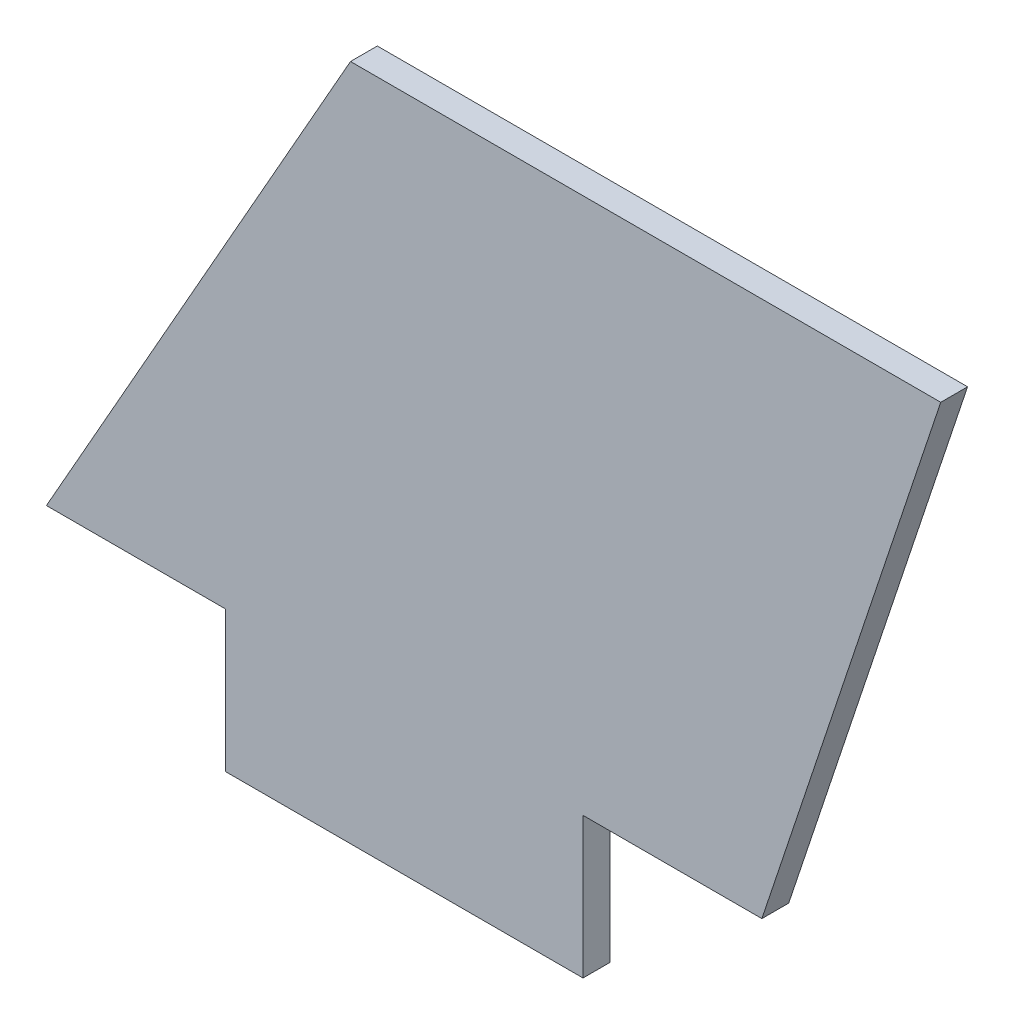
ISO-10303-21;
HEADER;
FILE_DESCRIPTION(('STEP AP214'),'2;1');
FILE_NAME('part.step','',(''),(''),'','','');
FILE_SCHEMA(('AUTOMOTIVE_DESIGN { 1 0 10303 214 1 1 1 1 }'));
ENDSEC;
DATA;
#1=APPLICATION_CONTEXT('core data for automotive mechanical design processes');
#2=APPLICATION_PROTOCOL_DEFINITION('international standard','automotive_design',2000,#1);
#3=PRODUCT_CONTEXT('',#1,'mechanical');
#4=PRODUCT('Part','Part','',(#3));
#5=PRODUCT_RELATED_PRODUCT_CATEGORY('part','',(#4));
#6=PRODUCT_DEFINITION_FORMATION('','',#4);
#7=PRODUCT_DEFINITION_CONTEXT('part definition',#1,'design');
#8=PRODUCT_DEFINITION('design','',#6,#7);
#9=PRODUCT_DEFINITION_SHAPE('','',#8);
#10=(LENGTH_UNIT() NAMED_UNIT(*) SI_UNIT(.MILLI.,.METRE.));
#11=(NAMED_UNIT(*) PLANE_ANGLE_UNIT() SI_UNIT($,.RADIAN.));
#12=(NAMED_UNIT(*) SI_UNIT($,.STERADIAN.) SOLID_ANGLE_UNIT());
#13=UNCERTAINTY_MEASURE_WITH_UNIT(LENGTH_MEASURE(1.E-05),#10,'distance_accuracy_value','');
#14=(GEOMETRIC_REPRESENTATION_CONTEXT(3) GLOBAL_UNCERTAINTY_ASSIGNED_CONTEXT((#13)) GLOBAL_UNIT_ASSIGNED_CONTEXT((#10,
#11,#12)) REPRESENTATION_CONTEXT('',''));
#15=CARTESIAN_POINT('',(0.,0.,0.));
#16=DIRECTION('',(0.,0.,1.));
#17=DIRECTION('',(1.,0.,0.));
#18=AXIS2_PLACEMENT_3D('',#15,#16,#17);
#19=CARTESIAN_POINT('',(17.,30.,1.5));
#20=DIRECTION('',(0.870022185848612,-0.49301257198088,0.));
#21=DIRECTION('',(0.49301257198088,0.870022185848612,0.));
#22=AXIS2_PLACEMENT_3D('',#19,#20,#21);
#23=PLANE('',#22);
#24=DIRECTION('',(-0.49301257198088,-0.870022185848612,0.));
#25=VECTOR('',#24,1.);
#26=CARTESIAN_POINT('',(17.,30.,0.));
#27=LINE('',#26,#25);
#28=CARTESIAN_POINT('',(17.,30.,0.));
#29=VERTEX_POINT('',#28);
#30=CARTESIAN_POINT('',(0.,0.,0.));
#31=VERTEX_POINT('',#30);
#32=EDGE_CURVE('E128',#29,#31,#27,.T.);
#33=ORIENTED_EDGE('',*,*,#32,.T.);
#34=DIRECTION('',(0.,0.,-1.));
#35=VECTOR('',#34,1.);
#36=CARTESIAN_POINT('',(0.,0.,1.5));
#37=LINE('',#36,#35);
#38=CARTESIAN_POINT('',(0.,0.,1.5));
#39=VERTEX_POINT('',#38);
#40=EDGE_CURVE('E11',#39,#31,#37,.T.);
#41=ORIENTED_EDGE('',*,*,#40,.F.);
#42=DIRECTION('',(-0.49301257198088,-0.870022185848612,0.));
#43=VECTOR('',#42,1.);
#44=CARTESIAN_POINT('',(17.,30.,1.5));
#45=LINE('',#44,#43);
#46=CARTESIAN_POINT('',(17.,30.,1.5));
#47=VERTEX_POINT('',#46);
#48=EDGE_CURVE('E142',#47,#39,#45,.T.);
#49=ORIENTED_EDGE('',*,*,#48,.F.);
#50=DIRECTION('',(0.,0.,-1.));
#51=VECTOR('',#50,1.);
#52=CARTESIAN_POINT('',(17.,30.,1.5));
#53=LINE('',#52,#51);
#54=EDGE_CURVE('E124',#47,#29,#53,.T.);
#55=ORIENTED_EDGE('',*,*,#54,.T.);
#56=EDGE_LOOP('',(#33,#41,#49,#55));
#57=FACE_BOUND('',#56,.T.);
#58=ADVANCED_FACE('F32',(#57),#23,.F.);
#59=CARTESIAN_POINT('',(0.,0.,1.5));
#60=DIRECTION('',(0.,1.,0.));
#61=DIRECTION('',(0.,0.,1.));
#62=AXIS2_PLACEMENT_3D('',#59,#60,#61);
#63=PLANE('',#62);
#64=DIRECTION('',(1.,0.,0.));
#65=VECTOR('',#64,1.);
#66=CARTESIAN_POINT('',(0.,0.,0.));
#67=LINE('',#66,#65);
#68=CARTESIAN_POINT('',(10.,0.,0.));
#69=VERTEX_POINT('',#68);
#70=EDGE_CURVE('E131',#31,#69,#67,.T.);
#71=ORIENTED_EDGE('',*,*,#70,.T.);
#72=DIRECTION('',(0.,0.,-1.));
#73=VECTOR('',#72,1.);
#74=CARTESIAN_POINT('',(10.,0.,1.5));
#75=LINE('',#74,#73);
#76=CARTESIAN_POINT('',(10.,0.,1.5));
#77=VERTEX_POINT('',#76);
#78=EDGE_CURVE('E40',#77,#69,#75,.T.);
#79=ORIENTED_EDGE('',*,*,#78,.F.);
#80=DIRECTION('',(1.,0.,0.));
#81=VECTOR('',#80,1.);
#82=CARTESIAN_POINT('',(0.,0.,1.5));
#83=LINE('',#82,#81);
#84=EDGE_CURVE('E91',#39,#77,#83,.T.);
#85=ORIENTED_EDGE('',*,*,#84,.F.);
#86=ORIENTED_EDGE('',*,*,#40,.T.);
#87=EDGE_LOOP('',(#71,#79,#85,#86));
#88=FACE_BOUND('',#87,.T.);
#89=ADVANCED_FACE('F177',(#88),#63,.F.);
#90=CARTESIAN_POINT('',(10.,0.,1.5));
#91=DIRECTION('',(1.,0.,0.));
#92=DIRECTION('',(0.,1.,0.));
#93=AXIS2_PLACEMENT_3D('',#90,#91,#92);
#94=PLANE('',#93);
#95=DIRECTION('',(0.,-1.,0.));
#96=VECTOR('',#95,1.);
#97=CARTESIAN_POINT('',(10.,0.,0.));
#98=LINE('',#97,#96);
#99=CARTESIAN_POINT('',(10.,-7.875,0.));
#100=VERTEX_POINT('',#99);
#101=EDGE_CURVE('E133',#69,#100,#98,.T.);
#102=ORIENTED_EDGE('',*,*,#101,.T.);
#103=DIRECTION('',(0.,0.,-1.));
#104=VECTOR('',#103,1.);
#105=CARTESIAN_POINT('',(10.,-7.875,1.5));
#106=LINE('',#105,#104);
#107=CARTESIAN_POINT('',(10.,-7.875,1.5));
#108=VERTEX_POINT('',#107);
#109=EDGE_CURVE('E149',#108,#100,#106,.T.);
#110=ORIENTED_EDGE('',*,*,#109,.F.);
#111=DIRECTION('',(0.,-1.,0.));
#112=VECTOR('',#111,1.);
#113=CARTESIAN_POINT('',(10.,0.,1.5));
#114=LINE('',#113,#112);
#115=EDGE_CURVE('E157',#77,#108,#114,.T.);
#116=ORIENTED_EDGE('',*,*,#115,.F.);
#117=ORIENTED_EDGE('',*,*,#78,.T.);
#118=EDGE_LOOP('',(#102,#110,#116,#117));
#119=FACE_BOUND('',#118,.T.);
#120=ADVANCED_FACE('F155',(#119),#94,.F.);
#121=CARTESIAN_POINT('',(10.,-7.875,1.5));
#122=DIRECTION('',(0.,1.,0.));
#123=DIRECTION('',(0.,0.,1.));
#124=AXIS2_PLACEMENT_3D('',#121,#122,#123);
#125=PLANE('',#124);
#126=DIRECTION('',(1.,0.,0.));
#127=VECTOR('',#126,1.);
#128=CARTESIAN_POINT('',(10.,-7.875,0.));
#129=LINE('',#128,#127);
#130=CARTESIAN_POINT('',(30.,-7.875,0.));
#131=VERTEX_POINT('',#130);
#132=EDGE_CURVE('E135',#100,#131,#129,.T.);
#133=ORIENTED_EDGE('',*,*,#132,.T.);
#134=DIRECTION('',(0.,0.,-1.));
#135=VECTOR('',#134,1.);
#136=CARTESIAN_POINT('',(30.,-7.875,1.5));
#137=LINE('',#136,#135);
#138=CARTESIAN_POINT('',(30.,-7.875,1.5));
#139=VERTEX_POINT('',#138);
#140=EDGE_CURVE('E146',#139,#131,#137,.T.);
#141=ORIENTED_EDGE('',*,*,#140,.F.);
#142=DIRECTION('',(1.,0.,0.));
#143=VECTOR('',#142,1.);
#144=CARTESIAN_POINT('',(10.,-7.875,1.5));
#145=LINE('',#144,#143);
#146=EDGE_CURVE('E169',#108,#139,#145,.T.);
#147=ORIENTED_EDGE('',*,*,#146,.F.);
#148=ORIENTED_EDGE('',*,*,#109,.T.);
#149=EDGE_LOOP('',(#133,#141,#147,#148));
#150=FACE_BOUND('',#149,.T.);
#151=ADVANCED_FACE('F165',(#150),#125,.F.);
#152=CARTESIAN_POINT('',(30.,-7.875,1.5));
#153=DIRECTION('',(-1.,0.,0.));
#154=DIRECTION('',(0.,0.,1.));
#155=AXIS2_PLACEMENT_3D('',#152,#153,#154);
#156=PLANE('',#155);
#157=DIRECTION('',(0.,1.,0.));
#158=VECTOR('',#157,1.);
#159=CARTESIAN_POINT('',(30.,-7.875,0.));
#160=LINE('',#159,#158);
#161=CARTESIAN_POINT('',(30.,0.,0.));
#162=VERTEX_POINT('',#161);
#163=EDGE_CURVE('E137',#131,#162,#160,.T.);
#164=ORIENTED_EDGE('',*,*,#163,.T.);
#165=DIRECTION('',(0.,0.,-1.));
#166=VECTOR('',#165,1.);
#167=CARTESIAN_POINT('',(30.,0.,1.5));
#168=LINE('',#167,#166);
#169=CARTESIAN_POINT('',(30.,0.,1.5));
#170=VERTEX_POINT('',#169);
#171=EDGE_CURVE('E119',#170,#162,#168,.T.);
#172=ORIENTED_EDGE('',*,*,#171,.F.);
#173=DIRECTION('',(0.,1.,0.));
#174=VECTOR('',#173,1.);
#175=CARTESIAN_POINT('',(30.,-7.875,1.5));
#176=LINE('',#175,#174);
#177=EDGE_CURVE('E110',#139,#170,#176,.T.);
#178=ORIENTED_EDGE('',*,*,#177,.F.);
#179=ORIENTED_EDGE('',*,*,#140,.T.);
#180=EDGE_LOOP('',(#164,#172,#178,#179));
#181=FACE_BOUND('',#180,.T.);
#182=ADVANCED_FACE('F168',(#181),#156,.F.);
#183=CARTESIAN_POINT('',(30.,0.,1.5));
#184=DIRECTION('',(0.,1.,0.));
#185=DIRECTION('',(0.,0.,1.));
#186=AXIS2_PLACEMENT_3D('',#183,#184,#185);
#187=PLANE('',#186);
#188=DIRECTION('',(1.,0.,0.));
#189=VECTOR('',#188,1.);
#190=CARTESIAN_POINT('',(30.,0.,0.));
#191=LINE('',#190,#189);
#192=CARTESIAN_POINT('',(40.,0.,0.));
#193=VERTEX_POINT('',#192);
#194=EDGE_CURVE('E118',#162,#193,#191,.T.);
#195=ORIENTED_EDGE('',*,*,#194,.T.);
#196=DIRECTION('',(0.,0.,-1.));
#197=VECTOR('',#196,1.);
#198=CARTESIAN_POINT('',(40.,0.,1.5));
#199=LINE('',#198,#197);
#200=CARTESIAN_POINT('',(40.,0.,1.5));
#201=VERTEX_POINT('',#200);
#202=EDGE_CURVE('E115',#201,#193,#199,.T.);
#203=ORIENTED_EDGE('',*,*,#202,.F.);
#204=DIRECTION('',(1.,0.,0.));
#205=VECTOR('',#204,1.);
#206=CARTESIAN_POINT('',(30.,0.,1.5));
#207=LINE('',#206,#205);
#208=EDGE_CURVE('E104',#170,#201,#207,.T.);
#209=ORIENTED_EDGE('',*,*,#208,.F.);
#210=ORIENTED_EDGE('',*,*,#171,.T.);
#211=EDGE_LOOP('',(#195,#203,#209,#210));
#212=FACE_BOUND('',#211,.T.);
#213=ADVANCED_FACE('F116',(#212),#187,.F.);
#214=CARTESIAN_POINT('',(40.,0.,1.5));
#215=DIRECTION('',(-0.948683298050514,0.316227766016838,0.));
#216=DIRECTION('',(-0.316227766016838,-0.948683298050514,0.));
#217=AXIS2_PLACEMENT_3D('',#214,#215,#216);
#218=PLANE('',#217);
#219=DIRECTION('',(0.316227766016838,0.948683298050514,0.));
#220=VECTOR('',#219,1.);
#221=CARTESIAN_POINT('',(40.,0.,0.));
#222=LINE('',#221,#220);
#223=CARTESIAN_POINT('',(50.,30.,0.));
#224=VERTEX_POINT('',#223);
#225=EDGE_CURVE('E77',#193,#224,#222,.T.);
#226=ORIENTED_EDGE('',*,*,#225,.T.);
#227=DIRECTION('',(0.,0.,-1.));
#228=VECTOR('',#227,1.);
#229=CARTESIAN_POINT('',(50.,30.,1.5));
#230=LINE('',#229,#228);
#231=CARTESIAN_POINT('',(50.,30.,1.5));
#232=VERTEX_POINT('',#231);
#233=EDGE_CURVE('E120',#232,#224,#230,.T.);
#234=ORIENTED_EDGE('',*,*,#233,.F.);
#235=DIRECTION('',(0.316227766016838,0.948683298050514,0.));
#236=VECTOR('',#235,1.);
#237=CARTESIAN_POINT('',(40.,0.,1.5));
#238=LINE('',#237,#236);
#239=EDGE_CURVE('E108',#201,#232,#238,.T.);
#240=ORIENTED_EDGE('',*,*,#239,.F.);
#241=ORIENTED_EDGE('',*,*,#202,.T.);
#242=EDGE_LOOP('',(#226,#234,#240,#241));
#243=FACE_BOUND('',#242,.T.);
#244=ADVANCED_FACE('F122',(#243),#218,.F.);
#245=CARTESIAN_POINT('',(50.,30.,1.5));
#246=DIRECTION('',(0.,-1.,0.));
#247=DIRECTION('',(1.,0.,0.));
#248=AXIS2_PLACEMENT_3D('',#245,#246,#247);
#249=PLANE('',#248);
#250=DIRECTION('',(-1.,0.,0.));
#251=VECTOR('',#250,1.);
#252=CARTESIAN_POINT('',(50.,30.,0.));
#253=LINE('',#252,#251);
#254=EDGE_CURVE('E83',#224,#29,#253,.T.);
#255=ORIENTED_EDGE('',*,*,#254,.T.);
#256=ORIENTED_EDGE('',*,*,#54,.F.);
#257=DIRECTION('',(-1.,0.,0.));
#258=VECTOR('',#257,1.);
#259=CARTESIAN_POINT('',(50.,30.,1.5));
#260=LINE('',#259,#258);
#261=EDGE_CURVE('E48',#232,#47,#260,.T.);
#262=ORIENTED_EDGE('',*,*,#261,.F.);
#263=ORIENTED_EDGE('',*,*,#233,.T.);
#264=EDGE_LOOP('',(#255,#256,#262,#263));
#265=FACE_BOUND('',#264,.T.);
#266=ADVANCED_FACE('F193',(#265),#249,.F.);
#267=CARTESIAN_POINT('',(0.,0.,1.5));
#268=DIRECTION('',(0.,0.,1.));
#269=DIRECTION('',(1.,0.,0.));
#270=AXIS2_PLACEMENT_3D('',#267,#268,#269);
#271=PLANE('',#270);
#272=ORIENTED_EDGE('',*,*,#48,.T.);
#273=ORIENTED_EDGE('',*,*,#84,.T.);
#274=ORIENTED_EDGE('',*,*,#115,.T.);
#275=ORIENTED_EDGE('',*,*,#146,.T.);
#276=ORIENTED_EDGE('',*,*,#177,.T.);
#277=ORIENTED_EDGE('',*,*,#208,.T.);
#278=ORIENTED_EDGE('',*,*,#239,.T.);
#279=ORIENTED_EDGE('',*,*,#261,.T.);
#280=EDGE_LOOP('',(#272,#273,#274,#275,#276,#277,#278,#279));
#281=FACE_BOUND('',#280,.T.);
#282=ADVANCED_FACE('F106',(#281),#271,.T.);
#283=CARTESIAN_POINT('',(0.,0.,0.));
#284=DIRECTION('',(0.,0.,1.));
#285=DIRECTION('',(1.,0.,0.));
#286=AXIS2_PLACEMENT_3D('',#283,#284,#285);
#287=PLANE('',#286);
#288=ORIENTED_EDGE('',*,*,#32,.F.);
#289=ORIENTED_EDGE('',*,*,#254,.F.);
#290=ORIENTED_EDGE('',*,*,#225,.F.);
#291=ORIENTED_EDGE('',*,*,#194,.F.);
#292=ORIENTED_EDGE('',*,*,#163,.F.);
#293=ORIENTED_EDGE('',*,*,#132,.F.);
#294=ORIENTED_EDGE('',*,*,#101,.F.);
#295=ORIENTED_EDGE('',*,*,#70,.F.);
#296=EDGE_LOOP('',(#288,#289,#290,#291,#292,#293,#294,#295));
#297=FACE_BOUND('',#296,.T.);
#298=ADVANCED_FACE('F161',(#297),#287,.F.);
#299=CLOSED_SHELL('',(#58,#89,#120,#151,#182,#213,#244,#266,#282,#298));
#300=MANIFOLD_SOLID_BREP('B2',#299);
#301=ADVANCED_BREP_SHAPE_REPRESENTATION('',(#18,#300),#14);
#302=SHAPE_DEFINITION_REPRESENTATION(#9,#301);
ENDSEC;
END-ISO-10303-21;
